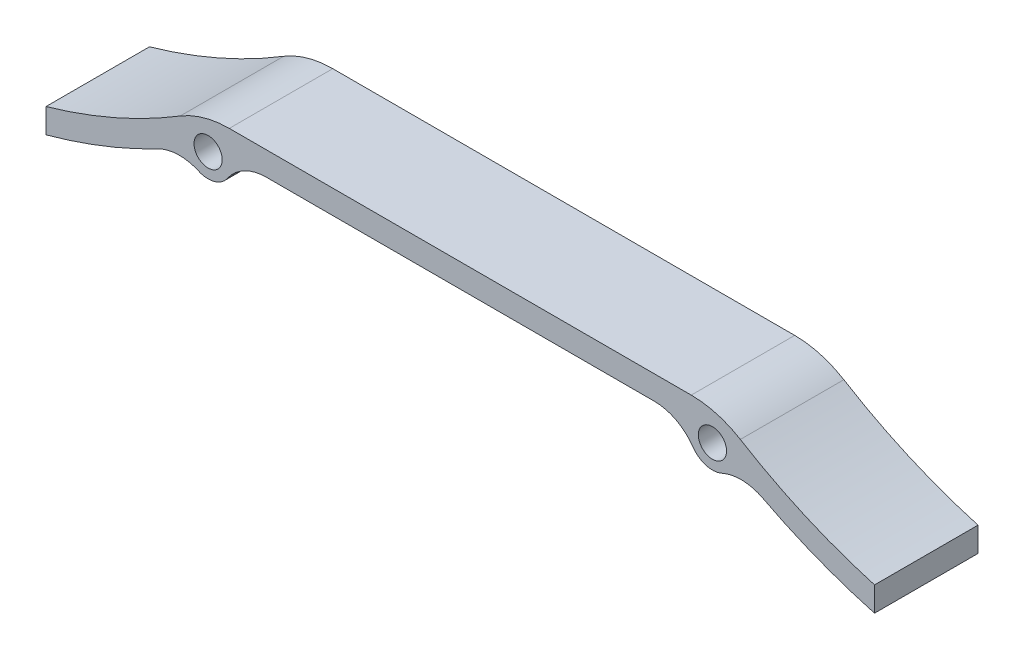
ISO-10303-21;
HEADER;
FILE_DESCRIPTION(('STEP AP214'),'2;1');
FILE_NAME('part.step','',(''),(''),'','','');
FILE_SCHEMA(('AUTOMOTIVE_DESIGN { 1 0 10303 214 1 1 1 1 }'));
ENDSEC;
DATA;
#1=APPLICATION_CONTEXT('core data for automotive mechanical design processes');
#2=APPLICATION_PROTOCOL_DEFINITION('international standard','automotive_design',2000,#1);
#3=PRODUCT_CONTEXT('',#1,'mechanical');
#4=PRODUCT('Part','Part','',(#3));
#5=PRODUCT_RELATED_PRODUCT_CATEGORY('part','',(#4));
#6=PRODUCT_DEFINITION_FORMATION('','',#4);
#7=PRODUCT_DEFINITION_CONTEXT('part definition',#1,'design');
#8=PRODUCT_DEFINITION('design','',#6,#7);
#9=PRODUCT_DEFINITION_SHAPE('','',#8);
#10=(LENGTH_UNIT() NAMED_UNIT(*) SI_UNIT(.MILLI.,.METRE.));
#11=(NAMED_UNIT(*) PLANE_ANGLE_UNIT() SI_UNIT($,.RADIAN.));
#12=(NAMED_UNIT(*) SI_UNIT($,.STERADIAN.) SOLID_ANGLE_UNIT());
#13=UNCERTAINTY_MEASURE_WITH_UNIT(LENGTH_MEASURE(1.E-05),#10,'distance_accuracy_value','');
#14=(GEOMETRIC_REPRESENTATION_CONTEXT(3) GLOBAL_UNCERTAINTY_ASSIGNED_CONTEXT((#13)) GLOBAL_UNIT_ASSIGNED_CONTEXT((#10,
#11,#12)) REPRESENTATION_CONTEXT('',''));
#15=CARTESIAN_POINT('',(0.,0.,0.));
#16=DIRECTION('',(0.,0.,1.));
#17=DIRECTION('',(1.,0.,0.));
#18=AXIS2_PLACEMENT_3D('',#15,#16,#17);
#19=CARTESIAN_POINT('',(-41.2650945557162,52.9463557748613,22.));
#20=DIRECTION('',(0.,0.,-1.));
#21=DIRECTION('',(-1.,0.,0.));
#22=AXIS2_PLACEMENT_3D('',#19,#20,#21);
#23=PLANE('',#22);
#24=CARTESIAN_POINT('',(-41.2650945557162,52.9463557748613,22.));
#25=DIRECTION('',(0.,0.,-1.));
#26=DIRECTION('',(-1.,0.,0.));
#27=AXIS2_PLACEMENT_3D('',#24,#25,#26);
#28=CIRCLE('',#27,9.99999999999999);
#29=CARTESIAN_POINT('',(-49.5045659519217,58.6130224415279,22.));
#30=VERTEX_POINT('',#29);
#31=CARTESIAN_POINT('',(-41.2650945557162,62.9463557748613,22.));
#32=VERTEX_POINT('',#31);
#33=EDGE_CURVE('E210',#30,#32,#28,.T.);
#34=ORIENTED_EDGE('',*,*,#33,.T.);
#35=DIRECTION('',(1.,0.,0.));
#36=VECTOR('',#35,1.);
#37=CARTESIAN_POINT('',(-41.2650945557162,62.9463557748613,22.));
#38=LINE('',#37,#36);
#39=CARTESIAN_POINT('',(41.2650945557162,62.9463557748613,22.));
#40=VERTEX_POINT('',#39);
#41=EDGE_CURVE('E118',#32,#40,#38,.T.);
#42=ORIENTED_EDGE('',*,*,#41,.T.);
#43=CARTESIAN_POINT('',(41.2650945557162,52.9463557748613,22.));
#44=DIRECTION('',(0.,0.,-1.));
#45=DIRECTION('',(1.,0.,0.));
#46=AXIS2_PLACEMENT_3D('',#43,#44,#45);
#47=CIRCLE('',#46,10.);
#48=CARTESIAN_POINT('',(49.5045659519217,58.6130224415279,22.));
#49=VERTEX_POINT('',#48);
#50=EDGE_CURVE('E249',#40,#49,#47,.T.);
#51=ORIENTED_EDGE('',*,*,#50,.T.);
#52=CARTESIAN_POINT('',(53.6243016500244,61.4463557748613,22.));
#53=DIRECTION('',(0.,0.,1.));
#54=DIRECTION('',(1.,0.,0.));
#55=AXIS2_PLACEMENT_3D('',#52,#53,#54);
#56=CIRCLE('',#55,5.00000000000004);
#57=CARTESIAN_POINT('',(55.6587719617918,56.8789790058025,22.));
#58=VERTEX_POINT('',#57);
#59=EDGE_CURVE('E268',#49,#58,#56,.T.);
#60=ORIENTED_EDGE('',*,*,#59,.T.);
#61=CARTESIAN_POINT('',(59.7277125853266,47.7442254676851,22.));
#62=DIRECTION('',(0.,0.,-1.));
#63=DIRECTION('',(1.,0.,0.));
#64=AXIS2_PLACEMENT_3D('',#61,#62,#63);
#65=CIRCLE('',#64,10.);
#66=CARTESIAN_POINT('',(64.3407364612325,56.6166552769494,22.));
#67=VERTEX_POINT('',#66);
#68=EDGE_CURVE('E265',#58,#67,#65,.T.);
#69=ORIENTED_EDGE('',*,*,#68,.T.);
#70=CARTESIAN_POINT('',(119.697022972102,163.085812988122,22.));
#71=DIRECTION('',(0.,0.,1.));
#72=DIRECTION('',(-1.,0.,0.));
#73=AXIS2_PLACEMENT_3D('',#70,#71,#72);
#74=CIRCLE('',#73,120.);
#75=CARTESIAN_POINT('',(88.0945177484953,47.3219081490405,22.));
#76=VERTEX_POINT('',#75);
#77=EDGE_CURVE('E267',#67,#76,#74,.T.);
#78=ORIENTED_EDGE('',*,*,#77,.T.);
#79=DIRECTION('',(0.,1.,0.));
#80=VECTOR('',#79,1.);
#81=CARTESIAN_POINT('',(88.0945177484953,47.3219081490405,22.));
#82=LINE('',#81,#80);
#83=CARTESIAN_POINT('',(88.0945177484953,52.5399693063621,22.));
#84=VERTEX_POINT('',#83);
#85=EDGE_CURVE('E270',#76,#84,#82,.T.);
#86=ORIENTED_EDGE('',*,*,#85,.T.);
#87=CARTESIAN_POINT('',(119.602505223607,163.139457213261,22.));
#88=DIRECTION('',(0.,0.,-1.));
#89=DIRECTION('',(-1.,0.,0.));
#90=AXIS2_PLACEMENT_3D('',#87,#88,#89);
#91=CIRCLE('',#90,115.);
#92=CARTESIAN_POINT('',(59.5611162901894,65.0576973649275,22.));
#93=VERTEX_POINT('',#92);
#94=EDGE_CURVE('E276',#84,#93,#91,.T.);
#95=ORIENTED_EDGE('',*,*,#94,.T.);
#96=CARTESIAN_POINT('',(49.1191356061168,48.,22.));
#97=DIRECTION('',(0.,0.,1.));
#98=DIRECTION('',(1.,0.,0.));
#99=AXIS2_PLACEMENT_3D('',#96,#97,#98);
#100=CIRCLE('',#99,20.);
#101=CARTESIAN_POINT('',(49.1191356061168,68.,22.));
#102=VERTEX_POINT('',#101);
#103=EDGE_CURVE('E278',#93,#102,#100,.T.);
#104=ORIENTED_EDGE('',*,*,#103,.T.);
#105=DIRECTION('',(-1.,0.,0.));
#106=VECTOR('',#105,1.);
#107=CARTESIAN_POINT('',(-49.1191356061168,68.,22.));
#108=LINE('',#107,#106);
#109=CARTESIAN_POINT('',(-49.1191356061168,68.,22.));
#110=VERTEX_POINT('',#109);
#111=EDGE_CURVE('E280',#102,#110,#108,.T.);
#112=ORIENTED_EDGE('',*,*,#111,.T.);
#113=CARTESIAN_POINT('',(-49.1191356061168,48.,22.));
#114=DIRECTION('',(0.,0.,1.));
#115=DIRECTION('',(-1.,0.,0.));
#116=AXIS2_PLACEMENT_3D('',#113,#114,#115);
#117=CIRCLE('',#116,20.);
#118=CARTESIAN_POINT('',(-59.5611162901894,65.0576973649275,22.));
#119=VERTEX_POINT('',#118);
#120=EDGE_CURVE('E282',#110,#119,#117,.T.);
#121=ORIENTED_EDGE('',*,*,#120,.T.);
#122=CARTESIAN_POINT('',(-119.602505223607,163.139457213261,22.));
#123=DIRECTION('',(0.,0.,-1.));
#124=DIRECTION('',(1.,0.,0.));
#125=AXIS2_PLACEMENT_3D('',#122,#123,#124);
#126=CIRCLE('',#125,115.);
#127=CARTESIAN_POINT('',(-88.0945177484953,52.5399693063621,22.));
#128=VERTEX_POINT('',#127);
#129=EDGE_CURVE('E284',#119,#128,#126,.T.);
#130=ORIENTED_EDGE('',*,*,#129,.T.);
#131=DIRECTION('',(0.,-1.,0.));
#132=VECTOR('',#131,1.);
#133=CARTESIAN_POINT('',(-88.0945177484953,47.3219081490405,22.));
#134=LINE('',#133,#132);
#135=CARTESIAN_POINT('',(-88.0945177484953,47.3219081490405,22.));
#136=VERTEX_POINT('',#135);
#137=EDGE_CURVE('E161',#128,#136,#134,.T.);
#138=ORIENTED_EDGE('',*,*,#137,.T.);
#139=CARTESIAN_POINT('',(-119.697022972102,163.085812988122,22.));
#140=DIRECTION('',(0.,0.,1.));
#141=DIRECTION('',(1.,0.,0.));
#142=AXIS2_PLACEMENT_3D('',#139,#140,#141);
#143=CIRCLE('',#142,120.);
#144=CARTESIAN_POINT('',(-64.3407364612324,56.6166552769495,22.));
#145=VERTEX_POINT('',#144);
#146=EDGE_CURVE('E155',#136,#145,#143,.T.);
#147=ORIENTED_EDGE('',*,*,#146,.T.);
#148=CARTESIAN_POINT('',(-59.7277125853266,47.7442254676851,22.));
#149=DIRECTION('',(0.,0.,-1.));
#150=DIRECTION('',(-1.,0.,0.));
#151=AXIS2_PLACEMENT_3D('',#148,#149,#150);
#152=CIRCLE('',#151,10.);
#153=CARTESIAN_POINT('',(-55.6587719617918,56.8789790058026,22.));
#154=VERTEX_POINT('',#153);
#155=EDGE_CURVE('E159',#145,#154,#152,.T.);
#156=ORIENTED_EDGE('',*,*,#155,.T.);
#157=CARTESIAN_POINT('',(-53.6243016500244,61.4463557748613,22.));
#158=DIRECTION('',(0.,0.,1.));
#159=DIRECTION('',(-1.,0.,0.));
#160=AXIS2_PLACEMENT_3D('',#157,#158,#159);
#161=CIRCLE('',#160,5.00000000000004);
#162=EDGE_CURVE('E51',#154,#30,#161,.T.);
#163=ORIENTED_EDGE('',*,*,#162,.T.);
#164=EDGE_LOOP('',(#34,#42,#51,#60,#69,#78,#86,#95,#104,#112,#121,#130,#138,#147,#156,#163));
#165=FACE_BOUND('',#164,.T.);
#166=CARTESIAN_POINT('',(-53.6243016500244,61.4463557748613,22.));
#167=DIRECTION('',(0.,0.,1.));
#168=DIRECTION('',(-1.,0.,0.));
#169=AXIS2_PLACEMENT_3D('',#166,#167,#168);
#170=CIRCLE('',#169,3.);
#171=CARTESIAN_POINT('',(-56.6243016500244,61.4463557748613,22.));
#172=VERTEX_POINT('',#171);
#173=EDGE_CURVE('E183',#172,#172,#170,.T.);
#174=ORIENTED_EDGE('',*,*,#173,.F.);
#175=EDGE_LOOP('',(#174));
#176=FACE_BOUND('',#175,.T.);
#177=CARTESIAN_POINT('',(53.6243016500244,61.4463557748613,22.));
#178=DIRECTION('',(0.,0.,1.));
#179=DIRECTION('',(1.,0.,0.));
#180=AXIS2_PLACEMENT_3D('',#177,#178,#179);
#181=CIRCLE('',#180,3.);
#182=CARTESIAN_POINT('',(56.6243016500244,61.4463557748613,22.));
#183=VERTEX_POINT('',#182);
#184=EDGE_CURVE('E325',#183,#183,#181,.T.);
#185=ORIENTED_EDGE('',*,*,#184,.F.);
#186=EDGE_LOOP('',(#185));
#187=FACE_BOUND('',#186,.T.);
#188=ADVANCED_FACE('F34',(#165,#176,#187),#23,.F.);
#189=CARTESIAN_POINT('',(-41.2650945557162,52.9463557748613,0.));
#190=DIRECTION('',(0.,0.,-1.));
#191=DIRECTION('',(-1.,0.,0.));
#192=AXIS2_PLACEMENT_3D('',#189,#190,#191);
#193=PLANE('',#192);
#194=CARTESIAN_POINT('',(-53.6243016500244,61.4463557748613,0.));
#195=DIRECTION('',(0.,0.,1.));
#196=DIRECTION('',(-1.,0.,0.));
#197=AXIS2_PLACEMENT_3D('',#194,#195,#196);
#198=CIRCLE('',#197,3.);
#199=CARTESIAN_POINT('',(-56.6243016500244,61.4463557748613,0.));
#200=VERTEX_POINT('',#199);
#201=EDGE_CURVE('E330',#200,#200,#198,.T.);
#202=ORIENTED_EDGE('',*,*,#201,.T.);
#203=EDGE_LOOP('',(#202));
#204=FACE_BOUND('',#203,.T.);
#205=CARTESIAN_POINT('',(-41.2650945557162,52.9463557748613,0.));
#206=DIRECTION('',(0.,0.,-1.));
#207=DIRECTION('',(-1.,0.,0.));
#208=AXIS2_PLACEMENT_3D('',#205,#206,#207);
#209=CIRCLE('',#208,9.99999999999999);
#210=CARTESIAN_POINT('',(-49.5045659519217,58.6130224415279,0.));
#211=VERTEX_POINT('',#210);
#212=CARTESIAN_POINT('',(-41.2650945557162,62.9463557748613,0.));
#213=VERTEX_POINT('',#212);
#214=EDGE_CURVE('E179',#211,#213,#209,.T.);
#215=ORIENTED_EDGE('',*,*,#214,.F.);
#216=CARTESIAN_POINT('',(-53.6243016500244,61.4463557748613,0.));
#217=DIRECTION('',(0.,0.,1.));
#218=DIRECTION('',(-1.,0.,0.));
#219=AXIS2_PLACEMENT_3D('',#216,#217,#218);
#220=CIRCLE('',#219,5.00000000000004);
#221=CARTESIAN_POINT('',(-55.6587719617918,56.8789790058026,0.));
#222=VERTEX_POINT('',#221);
#223=EDGE_CURVE('E110',#222,#211,#220,.T.);
#224=ORIENTED_EDGE('',*,*,#223,.F.);
#225=CARTESIAN_POINT('',(-59.7277125853266,47.7442254676851,0.));
#226=DIRECTION('',(0.,0.,-1.));
#227=DIRECTION('',(-1.,0.,0.));
#228=AXIS2_PLACEMENT_3D('',#225,#226,#227);
#229=CIRCLE('',#228,10.);
#230=CARTESIAN_POINT('',(-64.3407364612324,56.6166552769495,0.));
#231=VERTEX_POINT('',#230);
#232=EDGE_CURVE('E104',#231,#222,#229,.T.);
#233=ORIENTED_EDGE('',*,*,#232,.F.);
#234=CARTESIAN_POINT('',(-119.697022972102,163.085812988122,0.));
#235=DIRECTION('',(0.,0.,1.));
#236=DIRECTION('',(1.,0.,0.));
#237=AXIS2_PLACEMENT_3D('',#234,#235,#236);
#238=CIRCLE('',#237,120.);
#239=CARTESIAN_POINT('',(-88.0945177484953,47.3219081490405,0.));
#240=VERTEX_POINT('',#239);
#241=EDGE_CURVE('E169',#240,#231,#238,.T.);
#242=ORIENTED_EDGE('',*,*,#241,.F.);
#243=DIRECTION('',(0.,-1.,0.));
#244=VECTOR('',#243,1.);
#245=CARTESIAN_POINT('',(-88.0945177484953,47.3219081490405,0.));
#246=LINE('',#245,#244);
#247=CARTESIAN_POINT('',(-88.0945177484953,52.5399693063621,0.));
#248=VERTEX_POINT('',#247);
#249=EDGE_CURVE('E205',#248,#240,#246,.T.);
#250=ORIENTED_EDGE('',*,*,#249,.F.);
#251=CARTESIAN_POINT('',(-119.602505223607,163.139457213261,0.));
#252=DIRECTION('',(0.,0.,-1.));
#253=DIRECTION('',(1.,0.,0.));
#254=AXIS2_PLACEMENT_3D('',#251,#252,#253);
#255=CIRCLE('',#254,115.);
#256=CARTESIAN_POINT('',(-59.5611162901894,65.0576973649275,0.));
#257=VERTEX_POINT('',#256);
#258=EDGE_CURVE('E203',#257,#248,#255,.T.);
#259=ORIENTED_EDGE('',*,*,#258,.F.);
#260=CARTESIAN_POINT('',(-49.1191356061168,48.,0.));
#261=DIRECTION('',(0.,0.,1.));
#262=DIRECTION('',(-1.,0.,0.));
#263=AXIS2_PLACEMENT_3D('',#260,#261,#262);
#264=CIRCLE('',#263,20.);
#265=CARTESIAN_POINT('',(-49.1191356061168,68.,0.));
#266=VERTEX_POINT('',#265);
#267=EDGE_CURVE('E201',#266,#257,#264,.T.);
#268=ORIENTED_EDGE('',*,*,#267,.F.);
#269=DIRECTION('',(-1.,0.,0.));
#270=VECTOR('',#269,1.);
#271=CARTESIAN_POINT('',(-49.1191356061168,68.,0.));
#272=LINE('',#271,#270);
#273=CARTESIAN_POINT('',(49.1191356061168,68.,0.));
#274=VERTEX_POINT('',#273);
#275=EDGE_CURVE('E199',#274,#266,#272,.T.);
#276=ORIENTED_EDGE('',*,*,#275,.F.);
#277=CARTESIAN_POINT('',(49.1191356061168,48.,0.));
#278=DIRECTION('',(0.,0.,1.));
#279=DIRECTION('',(1.,0.,0.));
#280=AXIS2_PLACEMENT_3D('',#277,#278,#279);
#281=CIRCLE('',#280,20.);
#282=CARTESIAN_POINT('',(59.5611162901894,65.0576973649275,0.));
#283=VERTEX_POINT('',#282);
#284=EDGE_CURVE('E197',#283,#274,#281,.T.);
#285=ORIENTED_EDGE('',*,*,#284,.F.);
#286=CARTESIAN_POINT('',(119.602505223607,163.139457213261,0.));
#287=DIRECTION('',(0.,0.,-1.));
#288=DIRECTION('',(-1.,0.,0.));
#289=AXIS2_PLACEMENT_3D('',#286,#287,#288);
#290=CIRCLE('',#289,115.);
#291=CARTESIAN_POINT('',(88.0945177484953,52.5399693063621,0.));
#292=VERTEX_POINT('',#291);
#293=EDGE_CURVE('E195',#292,#283,#290,.T.);
#294=ORIENTED_EDGE('',*,*,#293,.F.);
#295=DIRECTION('',(0.,1.,0.));
#296=VECTOR('',#295,1.);
#297=CARTESIAN_POINT('',(88.0945177484953,47.3219081490405,0.));
#298=LINE('',#297,#296);
#299=CARTESIAN_POINT('',(88.0945177484953,47.3219081490405,0.));
#300=VERTEX_POINT('',#299);
#301=EDGE_CURVE('E193',#300,#292,#298,.T.);
#302=ORIENTED_EDGE('',*,*,#301,.F.);
#303=CARTESIAN_POINT('',(119.697022972102,163.085812988122,0.));
#304=DIRECTION('',(0.,0.,1.));
#305=DIRECTION('',(-1.,0.,0.));
#306=AXIS2_PLACEMENT_3D('',#303,#304,#305);
#307=CIRCLE('',#306,120.);
#308=CARTESIAN_POINT('',(64.3407364612325,56.6166552769494,0.));
#309=VERTEX_POINT('',#308);
#310=EDGE_CURVE('E191',#309,#300,#307,.T.);
#311=ORIENTED_EDGE('',*,*,#310,.F.);
#312=CARTESIAN_POINT('',(59.7277125853266,47.7442254676851,0.));
#313=DIRECTION('',(0.,0.,-1.));
#314=DIRECTION('',(1.,0.,0.));
#315=AXIS2_PLACEMENT_3D('',#312,#313,#314);
#316=CIRCLE('',#315,10.);
#317=CARTESIAN_POINT('',(55.6587719617918,56.8789790058025,0.));
#318=VERTEX_POINT('',#317);
#319=EDGE_CURVE('E189',#318,#309,#316,.T.);
#320=ORIENTED_EDGE('',*,*,#319,.F.);
#321=CARTESIAN_POINT('',(53.6243016500244,61.4463557748613,0.));
#322=DIRECTION('',(0.,0.,1.));
#323=DIRECTION('',(1.,0.,0.));
#324=AXIS2_PLACEMENT_3D('',#321,#322,#323);
#325=CIRCLE('',#324,5.00000000000004);
#326=CARTESIAN_POINT('',(49.5045659519217,58.6130224415279,0.));
#327=VERTEX_POINT('',#326);
#328=EDGE_CURVE('E187',#327,#318,#325,.T.);
#329=ORIENTED_EDGE('',*,*,#328,.F.);
#330=CARTESIAN_POINT('',(41.2650945557162,52.9463557748613,0.));
#331=DIRECTION('',(0.,0.,-1.));
#332=DIRECTION('',(1.,0.,0.));
#333=AXIS2_PLACEMENT_3D('',#330,#331,#332);
#334=CIRCLE('',#333,10.);
#335=CARTESIAN_POINT('',(41.2650945557162,62.9463557748613,0.));
#336=VERTEX_POINT('',#335);
#337=EDGE_CURVE('E185',#336,#327,#334,.T.);
#338=ORIENTED_EDGE('',*,*,#337,.F.);
#339=DIRECTION('',(1.,0.,0.));
#340=VECTOR('',#339,1.);
#341=CARTESIAN_POINT('',(-41.2650945557162,62.9463557748613,0.));
#342=LINE('',#341,#340);
#343=EDGE_CURVE('E182',#213,#336,#342,.T.);
#344=ORIENTED_EDGE('',*,*,#343,.F.);
#345=EDGE_LOOP('',(#215,#224,#233,#242,#250,#259,#268,#276,#285,#294,#302,#311,#320,#329,#338,#344));
#346=FACE_BOUND('',#345,.T.);
#347=CARTESIAN_POINT('',(53.6243016500244,61.4463557748613,0.));
#348=DIRECTION('',(0.,0.,1.));
#349=DIRECTION('',(1.,0.,0.));
#350=AXIS2_PLACEMENT_3D('',#347,#348,#349);
#351=CIRCLE('',#350,3.);
#352=CARTESIAN_POINT('',(56.6243016500244,61.4463557748613,0.));
#353=VERTEX_POINT('',#352);
#354=EDGE_CURVE('E328',#353,#353,#351,.T.);
#355=ORIENTED_EDGE('',*,*,#354,.T.);
#356=EDGE_LOOP('',(#355));
#357=FACE_BOUND('',#356,.T.);
#358=ADVANCED_FACE('F253',(#204,#346,#357),#193,.T.);
#359=CARTESIAN_POINT('',(-41.2650945557162,52.9463557748613,22.));
#360=DIRECTION('',(0.,0.,-1.));
#361=DIRECTION('',(-1.,0.,0.));
#362=AXIS2_PLACEMENT_3D('',#359,#360,#361);
#363=CYLINDRICAL_SURFACE('',#362,9.99999999999999);
#364=ORIENTED_EDGE('',*,*,#214,.T.);
#365=DIRECTION('',(0.,0.,-1.));
#366=VECTOR('',#365,1.);
#367=CARTESIAN_POINT('',(-41.2650945557162,62.9463557748613,22.));
#368=LINE('',#367,#366);
#369=EDGE_CURVE('E11',#32,#213,#368,.T.);
#370=ORIENTED_EDGE('',*,*,#369,.F.);
#371=ORIENTED_EDGE('',*,*,#33,.F.);
#372=DIRECTION('',(0.,0.,-1.));
#373=VECTOR('',#372,1.);
#374=CARTESIAN_POINT('',(-49.5045659519217,58.6130224415279,22.));
#375=LINE('',#374,#373);
#376=EDGE_CURVE('E175',#30,#211,#375,.T.);
#377=ORIENTED_EDGE('',*,*,#376,.T.);
#378=EDGE_LOOP('',(#364,#370,#371,#377));
#379=FACE_BOUND('',#378,.T.);
#380=ADVANCED_FACE('F36',(#379),#363,.F.);
#381=CARTESIAN_POINT('',(-41.2650945557162,62.9463557748613,22.));
#382=DIRECTION('',(0.,1.,0.));
#383=DIRECTION('',(0.,0.,1.));
#384=AXIS2_PLACEMENT_3D('',#381,#382,#383);
#385=PLANE('',#384);
#386=ORIENTED_EDGE('',*,*,#343,.T.);
#387=DIRECTION('',(0.,0.,-1.));
#388=VECTOR('',#387,1.);
#389=CARTESIAN_POINT('',(41.2650945557162,62.9463557748613,22.));
#390=LINE('',#389,#388);
#391=EDGE_CURVE('E43',#40,#336,#390,.T.);
#392=ORIENTED_EDGE('',*,*,#391,.F.);
#393=ORIENTED_EDGE('',*,*,#41,.F.);
#394=ORIENTED_EDGE('',*,*,#369,.T.);
#395=EDGE_LOOP('',(#386,#392,#393,#394));
#396=FACE_BOUND('',#395,.T.);
#397=ADVANCED_FACE('F465',(#396),#385,.F.);
#398=CARTESIAN_POINT('',(41.2650945557162,52.9463557748613,22.));
#399=DIRECTION('',(0.,0.,-1.));
#400=DIRECTION('',(-1.,0.,0.));
#401=AXIS2_PLACEMENT_3D('',#398,#399,#400);
#402=CYLINDRICAL_SURFACE('',#401,10.);
#403=ORIENTED_EDGE('',*,*,#337,.T.);
#404=DIRECTION('',(0.,0.,-1.));
#405=VECTOR('',#404,1.);
#406=CARTESIAN_POINT('',(49.5045659519217,58.6130224415279,22.));
#407=LINE('',#406,#405);
#408=EDGE_CURVE('E241',#49,#327,#407,.T.);
#409=ORIENTED_EDGE('',*,*,#408,.F.);
#410=ORIENTED_EDGE('',*,*,#50,.F.);
#411=ORIENTED_EDGE('',*,*,#391,.T.);
#412=EDGE_LOOP('',(#403,#409,#410,#411));
#413=FACE_BOUND('',#412,.T.);
#414=ADVANCED_FACE('F247',(#413),#402,.F.);
#415=CARTESIAN_POINT('',(53.6243016500244,61.4463557748613,22.));
#416=DIRECTION('',(0.,0.,-1.));
#417=DIRECTION('',(-1.,0.,0.));
#418=AXIS2_PLACEMENT_3D('',#415,#416,#417);
#419=CYLINDRICAL_SURFACE('',#418,5.00000000000004);
#420=ORIENTED_EDGE('',*,*,#328,.T.);
#421=DIRECTION('',(0.,0.,-1.));
#422=VECTOR('',#421,1.);
#423=CARTESIAN_POINT('',(55.6587719617918,56.8789790058025,22.));
#424=LINE('',#423,#422);
#425=EDGE_CURVE('E238',#58,#318,#424,.T.);
#426=ORIENTED_EDGE('',*,*,#425,.F.);
#427=ORIENTED_EDGE('',*,*,#59,.F.);
#428=ORIENTED_EDGE('',*,*,#408,.T.);
#429=EDGE_LOOP('',(#420,#426,#427,#428));
#430=FACE_BOUND('',#429,.T.);
#431=ADVANCED_FACE('F259',(#430),#419,.T.);
#432=CARTESIAN_POINT('',(59.7277125853266,47.7442254676851,22.));
#433=DIRECTION('',(0.,0.,-1.));
#434=DIRECTION('',(-1.,0.,0.));
#435=AXIS2_PLACEMENT_3D('',#432,#433,#434);
#436=CYLINDRICAL_SURFACE('',#435,10.);
#437=ORIENTED_EDGE('',*,*,#319,.T.);
#438=DIRECTION('',(0.,0.,-1.));
#439=VECTOR('',#438,1.);
#440=CARTESIAN_POINT('',(64.3407364612325,56.6166552769494,22.));
#441=LINE('',#440,#439);
#442=EDGE_CURVE('E235',#67,#309,#441,.T.);
#443=ORIENTED_EDGE('',*,*,#442,.F.);
#444=ORIENTED_EDGE('',*,*,#68,.F.);
#445=ORIENTED_EDGE('',*,*,#425,.T.);
#446=EDGE_LOOP('',(#437,#443,#444,#445));
#447=FACE_BOUND('',#446,.T.);
#448=ADVANCED_FACE('F263',(#447),#436,.F.);
#449=CARTESIAN_POINT('',(119.697022972102,163.085812988122,22.));
#450=DIRECTION('',(0.,0.,-1.));
#451=DIRECTION('',(-1.,0.,0.));
#452=AXIS2_PLACEMENT_3D('',#449,#450,#451);
#453=CYLINDRICAL_SURFACE('',#452,120.);
#454=ORIENTED_EDGE('',*,*,#310,.T.);
#455=DIRECTION('',(0.,0.,-1.));
#456=VECTOR('',#455,1.);
#457=CARTESIAN_POINT('',(88.0945177484953,47.3219081490405,22.));
#458=LINE('',#457,#456);
#459=EDGE_CURVE('E232',#76,#300,#458,.T.);
#460=ORIENTED_EDGE('',*,*,#459,.F.);
#461=ORIENTED_EDGE('',*,*,#77,.F.);
#462=ORIENTED_EDGE('',*,*,#442,.T.);
#463=EDGE_LOOP('',(#454,#460,#461,#462));
#464=FACE_BOUND('',#463,.T.);
#465=ADVANCED_FACE('F430',(#464),#453,.T.);
#466=CARTESIAN_POINT('',(88.0945177484953,47.3219081490405,22.));
#467=DIRECTION('',(-1.,0.,0.));
#468=DIRECTION('',(0.,-1.,0.));
#469=AXIS2_PLACEMENT_3D('',#466,#467,#468);
#470=PLANE('',#469);
#471=ORIENTED_EDGE('',*,*,#301,.T.);
#472=DIRECTION('',(0.,0.,-1.));
#473=VECTOR('',#472,1.);
#474=CARTESIAN_POINT('',(88.0945177484953,52.5399693063621,22.));
#475=LINE('',#474,#473);
#476=EDGE_CURVE('E229',#84,#292,#475,.T.);
#477=ORIENTED_EDGE('',*,*,#476,.F.);
#478=ORIENTED_EDGE('',*,*,#85,.F.);
#479=ORIENTED_EDGE('',*,*,#459,.T.);
#480=EDGE_LOOP('',(#471,#477,#478,#479));
#481=FACE_BOUND('',#480,.T.);
#482=ADVANCED_FACE('F420',(#481),#470,.F.);
#483=CARTESIAN_POINT('',(119.602505223607,163.139457213261,22.));
#484=DIRECTION('',(0.,0.,-1.));
#485=DIRECTION('',(-1.,0.,0.));
#486=AXIS2_PLACEMENT_3D('',#483,#484,#485);
#487=CYLINDRICAL_SURFACE('',#486,115.);
#488=ORIENTED_EDGE('',*,*,#293,.T.);
#489=DIRECTION('',(0.,0.,-1.));
#490=VECTOR('',#489,1.);
#491=CARTESIAN_POINT('',(59.5611162901894,65.0576973649275,22.));
#492=LINE('',#491,#490);
#493=EDGE_CURVE('E226',#93,#283,#492,.T.);
#494=ORIENTED_EDGE('',*,*,#493,.F.);
#495=ORIENTED_EDGE('',*,*,#94,.F.);
#496=ORIENTED_EDGE('',*,*,#476,.T.);
#497=EDGE_LOOP('',(#488,#494,#495,#496));
#498=FACE_BOUND('',#497,.T.);
#499=ADVANCED_FACE('F410',(#498),#487,.F.);
#500=CARTESIAN_POINT('',(49.1191356061168,48.,22.));
#501=DIRECTION('',(0.,0.,-1.));
#502=DIRECTION('',(-1.,0.,0.));
#503=AXIS2_PLACEMENT_3D('',#500,#501,#502);
#504=CYLINDRICAL_SURFACE('',#503,20.);
#505=ORIENTED_EDGE('',*,*,#284,.T.);
#506=DIRECTION('',(0.,0.,-1.));
#507=VECTOR('',#506,1.);
#508=CARTESIAN_POINT('',(49.1191356061168,68.,22.));
#509=LINE('',#508,#507);
#510=EDGE_CURVE('E223',#102,#274,#509,.T.);
#511=ORIENTED_EDGE('',*,*,#510,.F.);
#512=ORIENTED_EDGE('',*,*,#103,.F.);
#513=ORIENTED_EDGE('',*,*,#493,.T.);
#514=EDGE_LOOP('',(#505,#511,#512,#513));
#515=FACE_BOUND('',#514,.T.);
#516=ADVANCED_FACE('F400',(#515),#504,.T.);
#517=CARTESIAN_POINT('',(-49.1191356061168,68.,22.));
#518=DIRECTION('',(0.,-1.,0.));
#519=DIRECTION('',(0.,0.,-1.));
#520=AXIS2_PLACEMENT_3D('',#517,#518,#519);
#521=PLANE('',#520);
#522=ORIENTED_EDGE('',*,*,#275,.T.);
#523=DIRECTION('',(0.,0.,-1.));
#524=VECTOR('',#523,1.);
#525=CARTESIAN_POINT('',(-49.1191356061168,68.,22.));
#526=LINE('',#525,#524);
#527=EDGE_CURVE('E220',#110,#266,#526,.T.);
#528=ORIENTED_EDGE('',*,*,#527,.F.);
#529=ORIENTED_EDGE('',*,*,#111,.F.);
#530=ORIENTED_EDGE('',*,*,#510,.T.);
#531=EDGE_LOOP('',(#522,#528,#529,#530));
#532=FACE_BOUND('',#531,.T.);
#533=ADVANCED_FACE('F390',(#532),#521,.F.);
#534=CARTESIAN_POINT('',(-49.1191356061168,48.,22.));
#535=DIRECTION('',(0.,0.,-1.));
#536=DIRECTION('',(-1.,0.,0.));
#537=AXIS2_PLACEMENT_3D('',#534,#535,#536);
#538=CYLINDRICAL_SURFACE('',#537,20.);
#539=ORIENTED_EDGE('',*,*,#267,.T.);
#540=DIRECTION('',(0.,0.,-1.));
#541=VECTOR('',#540,1.);
#542=CARTESIAN_POINT('',(-59.5611162901894,65.0576973649275,22.));
#543=LINE('',#542,#541);
#544=EDGE_CURVE('E217',#119,#257,#543,.T.);
#545=ORIENTED_EDGE('',*,*,#544,.F.);
#546=ORIENTED_EDGE('',*,*,#120,.F.);
#547=ORIENTED_EDGE('',*,*,#527,.T.);
#548=EDGE_LOOP('',(#539,#545,#546,#547));
#549=FACE_BOUND('',#548,.T.);
#550=ADVANCED_FACE('F381',(#549),#538,.T.);
#551=CARTESIAN_POINT('',(-119.602505223607,163.139457213261,22.));
#552=DIRECTION('',(0.,0.,-1.));
#553=DIRECTION('',(-1.,0.,0.));
#554=AXIS2_PLACEMENT_3D('',#551,#552,#553);
#555=CYLINDRICAL_SURFACE('',#554,115.);
#556=ORIENTED_EDGE('',*,*,#258,.T.);
#557=DIRECTION('',(0.,0.,-1.));
#558=VECTOR('',#557,1.);
#559=CARTESIAN_POINT('',(-88.0945177484953,52.5399693063621,22.));
#560=LINE('',#559,#558);
#561=EDGE_CURVE('E214',#128,#248,#560,.T.);
#562=ORIENTED_EDGE('',*,*,#561,.F.);
#563=ORIENTED_EDGE('',*,*,#129,.F.);
#564=ORIENTED_EDGE('',*,*,#544,.T.);
#565=EDGE_LOOP('',(#556,#562,#563,#564));
#566=FACE_BOUND('',#565,.T.);
#567=ADVANCED_FACE('F290',(#566),#555,.F.);
#568=CARTESIAN_POINT('',(-88.0945177484953,47.3219081490405,22.));
#569=DIRECTION('',(1.,0.,0.));
#570=DIRECTION('',(0.,1.,0.));
#571=AXIS2_PLACEMENT_3D('',#568,#569,#570);
#572=PLANE('',#571);
#573=ORIENTED_EDGE('',*,*,#249,.T.);
#574=DIRECTION('',(0.,0.,-1.));
#575=VECTOR('',#574,1.);
#576=CARTESIAN_POINT('',(-88.0945177484953,47.3219081490405,22.));
#577=LINE('',#576,#575);
#578=EDGE_CURVE('E170',#136,#240,#577,.T.);
#579=ORIENTED_EDGE('',*,*,#578,.F.);
#580=ORIENTED_EDGE('',*,*,#137,.F.);
#581=ORIENTED_EDGE('',*,*,#561,.T.);
#582=EDGE_LOOP('',(#573,#579,#580,#581));
#583=FACE_BOUND('',#582,.T.);
#584=ADVANCED_FACE('F294',(#583),#572,.F.);
#585=CARTESIAN_POINT('',(-119.697022972102,163.085812988122,22.));
#586=DIRECTION('',(0.,0.,-1.));
#587=DIRECTION('',(-1.,0.,0.));
#588=AXIS2_PLACEMENT_3D('',#585,#586,#587);
#589=CYLINDRICAL_SURFACE('',#588,120.);
#590=ORIENTED_EDGE('',*,*,#241,.T.);
#591=DIRECTION('',(0.,0.,-1.));
#592=VECTOR('',#591,1.);
#593=CARTESIAN_POINT('',(-64.3407364612324,56.6166552769495,22.));
#594=LINE('',#593,#592);
#595=EDGE_CURVE('E166',#145,#231,#594,.T.);
#596=ORIENTED_EDGE('',*,*,#595,.F.);
#597=ORIENTED_EDGE('',*,*,#146,.F.);
#598=ORIENTED_EDGE('',*,*,#578,.T.);
#599=EDGE_LOOP('',(#590,#596,#597,#598));
#600=FACE_BOUND('',#599,.T.);
#601=ADVANCED_FACE('F167',(#600),#589,.T.);
#602=CARTESIAN_POINT('',(-59.7277125853266,47.7442254676851,22.));
#603=DIRECTION('',(0.,0.,-1.));
#604=DIRECTION('',(-1.,0.,0.));
#605=AXIS2_PLACEMENT_3D('',#602,#603,#604);
#606=CYLINDRICAL_SURFACE('',#605,10.);
#607=ORIENTED_EDGE('',*,*,#232,.T.);
#608=DIRECTION('',(0.,0.,-1.));
#609=VECTOR('',#608,1.);
#610=CARTESIAN_POINT('',(-55.6587719617918,56.8789790058026,22.));
#611=LINE('',#610,#609);
#612=EDGE_CURVE('E171',#154,#222,#611,.T.);
#613=ORIENTED_EDGE('',*,*,#612,.F.);
#614=ORIENTED_EDGE('',*,*,#155,.F.);
#615=ORIENTED_EDGE('',*,*,#595,.T.);
#616=EDGE_LOOP('',(#607,#613,#614,#615));
#617=FACE_BOUND('',#616,.T.);
#618=ADVANCED_FACE('F173',(#617),#606,.F.);
#619=CARTESIAN_POINT('',(-53.6243016500244,61.4463557748613,22.));
#620=DIRECTION('',(0.,0.,-1.));
#621=DIRECTION('',(-1.,0.,0.));
#622=AXIS2_PLACEMENT_3D('',#619,#620,#621);
#623=CYLINDRICAL_SURFACE('',#622,5.00000000000004);
#624=ORIENTED_EDGE('',*,*,#223,.T.);
#625=ORIENTED_EDGE('',*,*,#376,.F.);
#626=ORIENTED_EDGE('',*,*,#162,.F.);
#627=ORIENTED_EDGE('',*,*,#612,.T.);
#628=EDGE_LOOP('',(#624,#625,#626,#627));
#629=FACE_BOUND('',#628,.T.);
#630=ADVANCED_FACE('F298',(#629),#623,.T.);
#631=CARTESIAN_POINT('',(-53.6243016500244,61.4463557748613,22.));
#632=DIRECTION('',(0.,0.,-1.));
#633=DIRECTION('',(-1.,0.,0.));
#634=AXIS2_PLACEMENT_3D('',#631,#632,#633);
#635=CYLINDRICAL_SURFACE('',#634,3.);
#636=ORIENTED_EDGE('',*,*,#173,.T.);
#637=EDGE_LOOP('',(#636));
#638=FACE_BOUND('',#637,.T.);
#639=ORIENTED_EDGE('',*,*,#201,.F.);
#640=EDGE_LOOP('',(#639));
#641=FACE_BOUND('',#640,.T.);
#642=ADVANCED_FACE('F300',(#638,#641),#635,.F.);
#643=CARTESIAN_POINT('',(53.6243016500244,61.4463557748613,22.));
#644=DIRECTION('',(0.,0.,-1.));
#645=DIRECTION('',(-1.,0.,0.));
#646=AXIS2_PLACEMENT_3D('',#643,#644,#645);
#647=CYLINDRICAL_SURFACE('',#646,3.);
#648=ORIENTED_EDGE('',*,*,#184,.T.);
#649=EDGE_LOOP('',(#648));
#650=FACE_BOUND('',#649,.T.);
#651=ORIENTED_EDGE('',*,*,#354,.F.);
#652=EDGE_LOOP('',(#651));
#653=FACE_BOUND('',#652,.T.);
#654=ADVANCED_FACE('F306',(#650,#653),#647,.F.);
#655=CLOSED_SHELL('',(#188,#358,#380,#397,#414,#431,#448,#465,#482,#499,#516,#533,#550,#567,
#584,#601,#618,#630,#642,#654));
#656=MANIFOLD_SOLID_BREP('B2',#655);
#657=ADVANCED_BREP_SHAPE_REPRESENTATION('',(#18,#656),#14);
#658=SHAPE_DEFINITION_REPRESENTATION(#9,#657);
ENDSEC;
END-ISO-10303-21;
